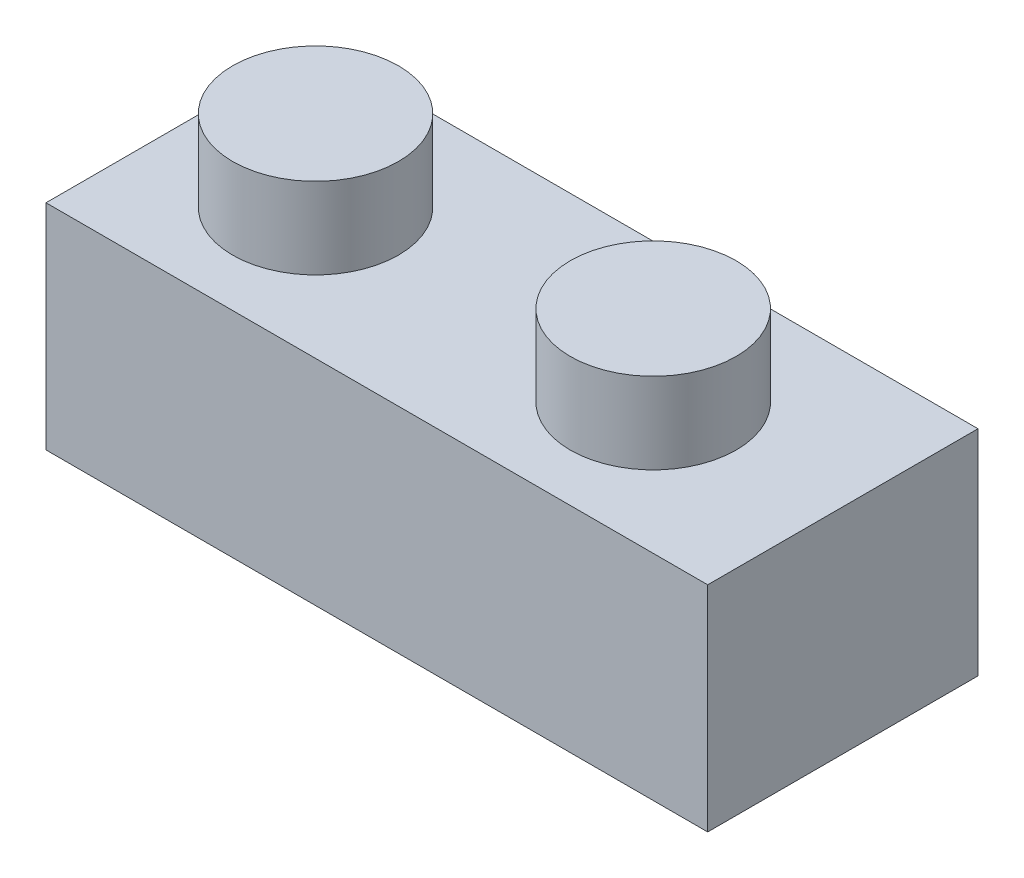
ISO-10303-21;
HEADER;
FILE_DESCRIPTION(('STEP AP214'),'2;1');
FILE_NAME('part.step','',(''),(''),'','','');
FILE_SCHEMA(('AUTOMOTIVE_DESIGN { 1 0 10303 214 1 1 1 1 }'));
ENDSEC;
DATA;
#1=APPLICATION_CONTEXT('core data for automotive mechanical design processes');
#2=APPLICATION_PROTOCOL_DEFINITION('international standard','automotive_design',2000,#1);
#3=PRODUCT_CONTEXT('',#1,'mechanical');
#4=PRODUCT('Part','Part','',(#3));
#5=PRODUCT_RELATED_PRODUCT_CATEGORY('part','',(#4));
#6=PRODUCT_DEFINITION_FORMATION('','',#4);
#7=PRODUCT_DEFINITION_CONTEXT('part definition',#1,'design');
#8=PRODUCT_DEFINITION('design','',#6,#7);
#9=PRODUCT_DEFINITION_SHAPE('','',#8);
#10=(LENGTH_UNIT() NAMED_UNIT(*) SI_UNIT(.MILLI.,.METRE.));
#11=(NAMED_UNIT(*) PLANE_ANGLE_UNIT() SI_UNIT($,.RADIAN.));
#12=(NAMED_UNIT(*) SI_UNIT($,.STERADIAN.) SOLID_ANGLE_UNIT());
#13=UNCERTAINTY_MEASURE_WITH_UNIT(LENGTH_MEASURE(1.E-05),#10,'distance_accuracy_value','');
#14=(GEOMETRIC_REPRESENTATION_CONTEXT(3) GLOBAL_UNCERTAINTY_ASSIGNED_CONTEXT((#13)) GLOBAL_UNIT_ASSIGNED_CONTEXT((#10,
#11,#12)) REPRESENTATION_CONTEXT('',''));
#15=CARTESIAN_POINT('',(0.,0.,0.));
#16=DIRECTION('',(0.,0.,1.));
#17=DIRECTION('',(1.,0.,0.));
#18=AXIS2_PLACEMENT_3D('',#15,#16,#17);
#19=CARTESIAN_POINT('',(0.,0.,0.01));
#20=DIRECTION('',(0.,1.,0.));
#21=DIRECTION('',(0.,0.,1.));
#22=AXIS2_PLACEMENT_3D('',#19,#20,#21);
#23=PLANE('',#22);
#24=DIRECTION('',(0.999961140271313,0.,0.00881577831473453));
#25=VECTOR('',#24,1.);
#26=CARTESIAN_POINT('',(0.000862531394720368,0.,0.000407757460154891));
#27=LINE('',#26,#25);
#28=CARTESIAN_POINT('',(0.000862531394720368,0.,0.000407757460154891));
#29=VERTEX_POINT('',#28);
#30=CARTESIAN_POINT('',(0.0237163099431462,0.,0.000609239135015069));
#31=VERTEX_POINT('',#30);
#32=EDGE_CURVE('E143',#29,#31,#27,.T.);
#33=ORIENTED_EDGE('',*,*,#32,.F.);
#34=DIRECTION('',(0.00881577831473453,0.,-0.999961140271313));
#35=VECTOR('',#34,1.);
#36=CARTESIAN_POINT('',(0.000784109218183198,0.,0.00930307291308525));
#37=LINE('',#36,#35);
#38=CARTESIAN_POINT('',(0.000784109218183198,0.,0.00930307291308525));
#39=VERTEX_POINT('',#38);
#40=EDGE_CURVE('E51',#39,#29,#37,.T.);
#41=ORIENTED_EDGE('',*,*,#40,.F.);
#42=DIRECTION('',(-0.999961140271313,0.,-0.00881577831473453));
#43=VECTOR('',#42,1.);
#44=CARTESIAN_POINT('',(0.000784109218183198,0.,0.00930307291308525));
#45=LINE('',#44,#43);
#46=CARTESIAN_POINT('',(0.023637887766609,0.,0.00950455458794542));
#47=VERTEX_POINT('',#46);
#48=EDGE_CURVE('E131',#47,#39,#45,.T.);
#49=ORIENTED_EDGE('',*,*,#48,.F.);
#50=DIRECTION('',(-0.00881577831473453,0.,0.999961140271313));
#51=VECTOR('',#50,1.);
#52=CARTESIAN_POINT('',(0.023637887766609,0.,0.00950455458794542));
#53=LINE('',#52,#51);
#54=EDGE_CURVE('E134',#31,#47,#53,.T.);
#55=ORIENTED_EDGE('',*,*,#54,.F.);
#56=EDGE_LOOP('',(#33,#41,#49,#55));
#57=FACE_BOUND('',#56,.T.);
#58=DIRECTION('',(1.,0.,0.));
#59=VECTOR('',#58,1.);
#60=CARTESIAN_POINT('',(0.,0.,0.));
#61=LINE('',#60,#59);
#62=CARTESIAN_POINT('',(0.,0.,0.));
#63=VERTEX_POINT('',#62);
#64=CARTESIAN_POINT('',(0.0244795631776094,0.,0.));
#65=VERTEX_POINT('',#64);
#66=EDGE_CURVE('E149',#63,#65,#61,.T.);
#67=ORIENTED_EDGE('',*,*,#66,.T.);
#68=DIRECTION('',(0.,0.,-1.));
#69=VECTOR('',#68,1.);
#70=CARTESIAN_POINT('',(0.0244795631776094,0.,0.01));
#71=LINE('',#70,#69);
#72=CARTESIAN_POINT('',(0.0244795631776094,0.,0.01));
#73=VERTEX_POINT('',#72);
#74=EDGE_CURVE('E173',#73,#65,#71,.T.);
#75=ORIENTED_EDGE('',*,*,#74,.F.);
#76=DIRECTION('',(1.,0.,0.));
#77=VECTOR('',#76,1.);
#78=CARTESIAN_POINT('',(0.,0.,0.01));
#79=LINE('',#78,#77);
#80=CARTESIAN_POINT('',(0.,0.,0.01));
#81=VERTEX_POINT('',#80);
#82=EDGE_CURVE('E153',#81,#73,#79,.T.);
#83=ORIENTED_EDGE('',*,*,#82,.F.);
#84=DIRECTION('',(0.,0.,-1.));
#85=VECTOR('',#84,1.);
#86=CARTESIAN_POINT('',(0.,0.,0.01));
#87=LINE('',#86,#85);
#88=EDGE_CURVE('E159',#81,#63,#87,.T.);
#89=ORIENTED_EDGE('',*,*,#88,.T.);
#90=EDGE_LOOP('',(#67,#75,#83,#89));
#91=FACE_BOUND('',#90,.T.);
#92=ADVANCED_FACE('F37',(#57,#91),#23,.F.);
#93=CARTESIAN_POINT('',(0.0244795631776094,0.,0.01));
#94=DIRECTION('',(-1.,0.,0.));
#95=DIRECTION('',(0.,0.,1.));
#96=AXIS2_PLACEMENT_3D('',#93,#94,#95);
#97=PLANE('',#96);
#98=DIRECTION('',(0.,1.,0.));
#99=VECTOR('',#98,1.);
#100=CARTESIAN_POINT('',(0.0244795631776094,0.,0.));
#101=LINE('',#100,#99);
#102=CARTESIAN_POINT('',(0.0244795631776094,0.00791951760061873,0.));
#103=VERTEX_POINT('',#102);
#104=EDGE_CURVE('E162',#65,#103,#101,.T.);
#105=ORIENTED_EDGE('',*,*,#104,.T.);
#106=DIRECTION('',(0.,0.,-1.));
#107=VECTOR('',#106,1.);
#108=CARTESIAN_POINT('',(0.0244795631776094,0.00791951760061873,0.01));
#109=LINE('',#108,#107);
#110=CARTESIAN_POINT('',(0.0244795631776094,0.00791951760061873,0.01));
#111=VERTEX_POINT('',#110);
#112=EDGE_CURVE('E170',#111,#103,#109,.T.);
#113=ORIENTED_EDGE('',*,*,#112,.F.);
#114=DIRECTION('',(0.,1.,0.));
#115=VECTOR('',#114,1.);
#116=CARTESIAN_POINT('',(0.0244795631776094,0.,0.01));
#117=LINE('',#116,#115);
#118=EDGE_CURVE('E89',#73,#111,#117,.T.);
#119=ORIENTED_EDGE('',*,*,#118,.F.);
#120=ORIENTED_EDGE('',*,*,#74,.T.);
#121=EDGE_LOOP('',(#105,#113,#119,#120));
#122=FACE_BOUND('',#121,.T.);
#123=ADVANCED_FACE('F183',(#122),#97,.F.);
#124=CARTESIAN_POINT('',(0.,0.00791951760061873,0.01));
#125=DIRECTION('',(0.,-1.,0.));
#126=DIRECTION('',(0.,0.,-1.));
#127=AXIS2_PLACEMENT_3D('',#124,#125,#126);
#128=PLANE('',#127);
#129=CARTESIAN_POINT('',(0.0176222206172123,0.00791951760061873,0.00515830703024725));
#130=DIRECTION('',(0.,-1.,0.));
#131=DIRECTION('',(0.,0.,-1.));
#132=AXIS2_PLACEMENT_3D('',#129,#130,#131);
#133=CIRCLE('',#132,0.003068475);
#134=CARTESIAN_POINT('',(0.0176222206172123,0.00791951760061873,0.00208983203024725));
#135=VERTEX_POINT('',#134);
#136=EDGE_CURVE('E11',#135,#135,#133,.F.);
#137=ORIENTED_EDGE('',*,*,#136,.F.);
#138=EDGE_LOOP('',(#137));
#139=FACE_BOUND('',#138,.T.);
#140=CARTESIAN_POINT('',(0.00513035677588131,0.00791951760061873,0.00515830703024725));
#141=DIRECTION('',(0.,-1.,0.));
#142=DIRECTION('',(0.,0.,-1.));
#143=AXIS2_PLACEMENT_3D('',#140,#141,#142);
#144=CIRCLE('',#143,0.00306847247840332);
#145=CARTESIAN_POINT('',(0.00513035677588131,0.00791951760061873,0.00208983455184393));
#146=VERTEX_POINT('',#145);
#147=EDGE_CURVE('E44',#146,#146,#144,.F.);
#148=ORIENTED_EDGE('',*,*,#147,.F.);
#149=EDGE_LOOP('',(#148));
#150=FACE_BOUND('',#149,.T.);
#151=DIRECTION('',(-1.,0.,0.));
#152=VECTOR('',#151,1.);
#153=CARTESIAN_POINT('',(0.,0.00791951760061873,0.));
#154=LINE('',#153,#152);
#155=CARTESIAN_POINT('',(0.,0.00791951760061873,0.));
#156=VERTEX_POINT('',#155);
#157=EDGE_CURVE('E164',#103,#156,#154,.T.);
#158=ORIENTED_EDGE('',*,*,#157,.T.);
#159=DIRECTION('',(0.,0.,-1.));
#160=VECTOR('',#159,1.);
#161=CARTESIAN_POINT('',(0.,0.00791951760061873,0.01));
#162=LINE('',#161,#160);
#163=CARTESIAN_POINT('',(0.,0.00791951760061873,0.01));
#164=VERTEX_POINT('',#163);
#165=EDGE_CURVE('E168',#164,#156,#162,.T.);
#166=ORIENTED_EDGE('',*,*,#165,.F.);
#167=DIRECTION('',(-1.,0.,0.));
#168=VECTOR('',#167,1.);
#169=CARTESIAN_POINT('',(0.,0.00791951760061873,0.01));
#170=LINE('',#169,#168);
#171=EDGE_CURVE('E156',#111,#164,#170,.T.);
#172=ORIENTED_EDGE('',*,*,#171,.F.);
#173=ORIENTED_EDGE('',*,*,#112,.T.);
#174=EDGE_LOOP('',(#158,#166,#172,#173));
#175=FACE_BOUND('',#174,.T.);
#176=ADVANCED_FACE('F179',(#139,#150,#175),#128,.F.);
#177=CARTESIAN_POINT('',(0.,0.,0.01));
#178=DIRECTION('',(1.,0.,0.));
#179=DIRECTION('',(0.,0.,-1.));
#180=AXIS2_PLACEMENT_3D('',#177,#178,#179);
#181=PLANE('',#180);
#182=DIRECTION('',(0.,-1.,0.));
#183=VECTOR('',#182,1.);
#184=CARTESIAN_POINT('',(0.,0.,0.));
#185=LINE('',#184,#183);
#186=EDGE_CURVE('E81',#156,#63,#185,.T.);
#187=ORIENTED_EDGE('',*,*,#186,.T.);
#188=ORIENTED_EDGE('',*,*,#88,.F.);
#189=DIRECTION('',(0.,-1.,0.));
#190=VECTOR('',#189,1.);
#191=CARTESIAN_POINT('',(0.,0.,0.01));
#192=LINE('',#191,#190);
#193=EDGE_CURVE('E60',#164,#81,#192,.T.);
#194=ORIENTED_EDGE('',*,*,#193,.F.);
#195=ORIENTED_EDGE('',*,*,#165,.T.);
#196=EDGE_LOOP('',(#187,#188,#194,#195));
#197=FACE_BOUND('',#196,.T.);
#198=ADVANCED_FACE('F182',(#197),#181,.F.);
#199=CARTESIAN_POINT('',(0.,0.,0.01));
#200=DIRECTION('',(0.,0.,1.));
#201=DIRECTION('',(1.,0.,0.));
#202=AXIS2_PLACEMENT_3D('',#199,#200,#201);
#203=PLANE('',#202);
#204=ORIENTED_EDGE('',*,*,#82,.T.);
#205=ORIENTED_EDGE('',*,*,#118,.T.);
#206=ORIENTED_EDGE('',*,*,#171,.T.);
#207=ORIENTED_EDGE('',*,*,#193,.T.);
#208=EDGE_LOOP('',(#204,#205,#206,#207));
#209=FACE_BOUND('',#208,.T.);
#210=ADVANCED_FACE('F195',(#209),#203,.T.);
#211=CARTESIAN_POINT('',(0.,0.,0.));
#212=DIRECTION('',(0.,0.,1.));
#213=DIRECTION('',(1.,0.,0.));
#214=AXIS2_PLACEMENT_3D('',#211,#212,#213);
#215=PLANE('',#214);
#216=ORIENTED_EDGE('',*,*,#66,.F.);
#217=ORIENTED_EDGE('',*,*,#186,.F.);
#218=ORIENTED_EDGE('',*,*,#157,.F.);
#219=ORIENTED_EDGE('',*,*,#104,.F.);
#220=EDGE_LOOP('',(#216,#217,#218,#219));
#221=FACE_BOUND('',#220,.T.);
#222=ADVANCED_FACE('F191',(#221),#215,.F.);
#223=CARTESIAN_POINT('',(0.000784109218183198,0.007,0.00930307291308525));
#224=DIRECTION('',(-0.999961140271313,0.,-0.00881577831473453));
#225=DIRECTION('',(-0.00881577831473453,0.,0.999961140271314));
#226=AXIS2_PLACEMENT_3D('',#223,#224,#225);
#227=PLANE('',#226);
#228=ORIENTED_EDGE('',*,*,#40,.T.);
#229=DIRECTION('',(0.,-1.,0.));
#230=VECTOR('',#229,1.);
#231=CARTESIAN_POINT('',(0.000862531394720368,0.007,0.000407757460154891));
#232=LINE('',#231,#230);
#233=CARTESIAN_POINT('',(0.000862531394720368,0.007,0.000407757460154891));
#234=VERTEX_POINT('',#233);
#235=EDGE_CURVE('E109',#234,#29,#232,.T.);
#236=ORIENTED_EDGE('',*,*,#235,.F.);
#237=DIRECTION('',(0.00881577831473453,0.,-0.999961140271313));
#238=VECTOR('',#237,1.);
#239=CARTESIAN_POINT('',(0.000784109218183198,0.007,0.00930307291308525));
#240=LINE('',#239,#238);
#241=CARTESIAN_POINT('',(0.000784109218183198,0.007,0.00930307291308525));
#242=VERTEX_POINT('',#241);
#243=EDGE_CURVE('E113',#242,#234,#240,.T.);
#244=ORIENTED_EDGE('',*,*,#243,.F.);
#245=DIRECTION('',(0.,-1.,0.));
#246=VECTOR('',#245,1.);
#247=CARTESIAN_POINT('',(0.000784109218183198,0.007,0.00930307291308525));
#248=LINE('',#247,#246);
#249=EDGE_CURVE('E147',#242,#39,#248,.T.);
#250=ORIENTED_EDGE('',*,*,#249,.T.);
#251=EDGE_LOOP('',(#228,#236,#244,#250));
#252=FACE_BOUND('',#251,.T.);
#253=ADVANCED_FACE('F111',(#252),#227,.F.);
#254=CARTESIAN_POINT('',(0.000784109218183198,0.007,0.00930307291308525));
#255=DIRECTION('',(-0.00881577831473453,0.,0.999961140271313));
#256=DIRECTION('',(0.999961140271314,0.,0.00881577831473454));
#257=AXIS2_PLACEMENT_3D('',#254,#255,#256);
#258=PLANE('',#257);
#259=ORIENTED_EDGE('',*,*,#48,.T.);
#260=ORIENTED_EDGE('',*,*,#249,.F.);
#261=DIRECTION('',(-0.999961140271313,0.,-0.00881577831473453));
#262=VECTOR('',#261,1.);
#263=CARTESIAN_POINT('',(0.000784109218183198,0.007,0.00930307291308525));
#264=LINE('',#263,#262);
#265=CARTESIAN_POINT('',(0.023637887766609,0.007,0.00950455458794542));
#266=VERTEX_POINT('',#265);
#267=EDGE_CURVE('E119',#266,#242,#264,.T.);
#268=ORIENTED_EDGE('',*,*,#267,.F.);
#269=DIRECTION('',(0.,-1.,0.));
#270=VECTOR('',#269,1.);
#271=CARTESIAN_POINT('',(0.023637887766609,0.007,0.00950455458794542));
#272=LINE('',#271,#270);
#273=EDGE_CURVE('E150',#266,#47,#272,.T.);
#274=ORIENTED_EDGE('',*,*,#273,.T.);
#275=EDGE_LOOP('',(#259,#260,#268,#274));
#276=FACE_BOUND('',#275,.T.);
#277=ADVANCED_FACE('F210',(#276),#258,.F.);
#278=CARTESIAN_POINT('',(0.023637887766609,0.007,0.00950455458794542));
#279=DIRECTION('',(0.999961140271313,0.,0.00881577831473453));
#280=DIRECTION('',(0.00881577831473453,0.,-0.999961140271314));
#281=AXIS2_PLACEMENT_3D('',#278,#279,#280);
#282=PLANE('',#281);
#283=ORIENTED_EDGE('',*,*,#54,.T.);
#284=ORIENTED_EDGE('',*,*,#273,.F.);
#285=DIRECTION('',(-0.00881577831473453,0.,0.999961140271313));
#286=VECTOR('',#285,1.);
#287=CARTESIAN_POINT('',(0.023637887766609,0.007,0.00950455458794542));
#288=LINE('',#287,#286);
#289=CARTESIAN_POINT('',(0.0237163099431462,0.007,0.000609239135015069));
#290=VERTEX_POINT('',#289);
#291=EDGE_CURVE('E127',#290,#266,#288,.T.);
#292=ORIENTED_EDGE('',*,*,#291,.F.);
#293=DIRECTION('',(0.,-1.,0.));
#294=VECTOR('',#293,1.);
#295=CARTESIAN_POINT('',(0.0237163099431462,0.007,0.000609239135015069));
#296=LINE('',#295,#294);
#297=EDGE_CURVE('E118',#290,#31,#296,.T.);
#298=ORIENTED_EDGE('',*,*,#297,.T.);
#299=EDGE_LOOP('',(#283,#284,#292,#298));
#300=FACE_BOUND('',#299,.T.);
#301=ADVANCED_FACE('F213',(#300),#282,.F.);
#302=CARTESIAN_POINT('',(0.000862531394720368,0.007,0.000407757460154891));
#303=DIRECTION('',(0.00881577831473453,0.,-0.999961140271313));
#304=DIRECTION('',(-0.999961140271314,0.,-0.00881577831473454));
#305=AXIS2_PLACEMENT_3D('',#302,#303,#304);
#306=PLANE('',#305);
#307=ORIENTED_EDGE('',*,*,#32,.T.);
#308=ORIENTED_EDGE('',*,*,#297,.F.);
#309=DIRECTION('',(0.999961140271313,0.,0.00881577831473453));
#310=VECTOR('',#309,1.);
#311=CARTESIAN_POINT('',(0.000862531394720368,0.007,0.000407757460154891));
#312=LINE('',#311,#310);
#313=EDGE_CURVE('E122',#234,#290,#312,.T.);
#314=ORIENTED_EDGE('',*,*,#313,.F.);
#315=ORIENTED_EDGE('',*,*,#235,.T.);
#316=EDGE_LOOP('',(#307,#308,#314,#315));
#317=FACE_BOUND('',#316,.T.);
#318=ADVANCED_FACE('F123',(#317),#306,.F.);
#319=CARTESIAN_POINT('',(0.,0.007,0.));
#320=DIRECTION('',(0.,-1.,0.));
#321=DIRECTION('',(0.,0.,-1.));
#322=AXIS2_PLACEMENT_3D('',#319,#320,#321);
#323=PLANE('',#322);
#324=CARTESIAN_POINT('',(0.0116670144620912,0.007,0.00496067358768393));
#325=DIRECTION('',(0.,-1.,0.));
#326=DIRECTION('',(0.,0.,-1.));
#327=AXIS2_PLACEMENT_3D('',#324,#325,#326);
#328=CIRCLE('',#327,0.00121060211636812);
#329=CARTESIAN_POINT('',(0.0116670144620912,0.007,0.0037500714713158));
#330=VERTEX_POINT('',#329);
#331=EDGE_CURVE('E251',#330,#330,#328,.T.);
#332=ORIENTED_EDGE('',*,*,#331,.F.);
#333=EDGE_LOOP('',(#332));
#334=FACE_BOUND('',#333,.T.);
#335=ORIENTED_EDGE('',*,*,#243,.T.);
#336=ORIENTED_EDGE('',*,*,#313,.T.);
#337=ORIENTED_EDGE('',*,*,#291,.T.);
#338=ORIENTED_EDGE('',*,*,#267,.T.);
#339=EDGE_LOOP('',(#335,#336,#337,#338));
#340=FACE_BOUND('',#339,.T.);
#341=ADVANCED_FACE('F129',(#334,#340),#323,.T.);
#342=CARTESIAN_POINT('',(0.00513035677588131,0.0109195176006187,0.00515830703024725));
#343=DIRECTION('',(0.,-1.,0.));
#344=DIRECTION('',(0.,0.,-1.));
#345=AXIS2_PLACEMENT_3D('',#342,#343,#344);
#346=CYLINDRICAL_SURFACE('',#345,0.00306847247840332);
#347=CARTESIAN_POINT('',(0.00513035677588131,0.0109195176006187,0.00515830703024725));
#348=DIRECTION('',(0.,1.,0.));
#349=DIRECTION('',(0.,0.,1.));
#350=AXIS2_PLACEMENT_3D('',#347,#348,#349);
#351=CIRCLE('',#350,0.00306847247840332);
#352=CARTESIAN_POINT('',(0.00513035677588131,0.0109195176006187,0.00822677950865058));
#353=VERTEX_POINT('',#352);
#354=EDGE_CURVE('E137',#353,#353,#351,.T.);
#355=ORIENTED_EDGE('',*,*,#354,.F.);
#356=EDGE_LOOP('',(#355));
#357=FACE_BOUND('',#356,.T.);
#358=ORIENTED_EDGE('',*,*,#147,.T.);
#359=EDGE_LOOP('',(#358));
#360=FACE_BOUND('',#359,.T.);
#361=ADVANCED_FACE('F177',(#357,#360),#346,.T.);
#362=CARTESIAN_POINT('',(0.00513035677588131,0.0109195176006187,0.00515830703024725));
#363=DIRECTION('',(0.,1.,0.));
#364=DIRECTION('',(0.,0.,1.));
#365=AXIS2_PLACEMENT_3D('',#362,#363,#364);
#366=PLANE('',#365);
#367=ORIENTED_EDGE('',*,*,#354,.T.);
#368=EDGE_LOOP('',(#367));
#369=FACE_BOUND('',#368,.T.);
#370=ADVANCED_FACE('F225',(#369),#366,.T.);
#371=CARTESIAN_POINT('',(0.0176222206172123,0.0109195176006187,0.00515830703024725));
#372=DIRECTION('',(0.,-1.,0.));
#373=DIRECTION('',(0.,0.,-1.));
#374=AXIS2_PLACEMENT_3D('',#371,#372,#373);
#375=CYLINDRICAL_SURFACE('',#374,0.003068475);
#376=CARTESIAN_POINT('',(0.0176222206172123,0.0109195176006187,0.00515830703024725));
#377=DIRECTION('',(0.,1.,0.));
#378=DIRECTION('',(0.,0.,1.));
#379=AXIS2_PLACEMENT_3D('',#376,#377,#378);
#380=CIRCLE('',#379,0.003068475);
#381=CARTESIAN_POINT('',(0.0176222206172123,0.0109195176006187,0.00822678203024725));
#382=VERTEX_POINT('',#381);
#383=EDGE_CURVE('E250',#382,#382,#380,.T.);
#384=ORIENTED_EDGE('',*,*,#383,.F.);
#385=EDGE_LOOP('',(#384));
#386=FACE_BOUND('',#385,.T.);
#387=ORIENTED_EDGE('',*,*,#136,.T.);
#388=EDGE_LOOP('',(#387));
#389=FACE_BOUND('',#388,.T.);
#390=ADVANCED_FACE('F229',(#386,#389),#375,.T.);
#391=CARTESIAN_POINT('',(0.0176222206172123,0.0109195176006187,0.00515830703024725));
#392=DIRECTION('',(0.,1.,0.));
#393=DIRECTION('',(0.,0.,1.));
#394=AXIS2_PLACEMENT_3D('',#391,#392,#393);
#395=PLANE('',#394);
#396=ORIENTED_EDGE('',*,*,#383,.T.);
#397=EDGE_LOOP('',(#396));
#398=FACE_BOUND('',#397,.T.);
#399=ADVANCED_FACE('F231',(#398),#395,.T.);
#400=CARTESIAN_POINT('',(0.0116670144620912,0.0005,0.00496067358768393));
#401=DIRECTION('',(0.,1.,0.));
#402=DIRECTION('',(0.,0.,1.));
#403=AXIS2_PLACEMENT_3D('',#400,#401,#402);
#404=CYLINDRICAL_SURFACE('',#403,0.00121060211636812);
#405=CARTESIAN_POINT('',(0.0116670144620912,0.0005,0.00496067358768393));
#406=DIRECTION('',(0.,-1.,0.));
#407=DIRECTION('',(0.,0.,-1.));
#408=AXIS2_PLACEMENT_3D('',#405,#406,#407);
#409=CIRCLE('',#408,0.00121060211636812);
#410=CARTESIAN_POINT('',(0.0116670144620912,0.0005,0.0037500714713158));
#411=VERTEX_POINT('',#410);
#412=EDGE_CURVE('E249',#411,#411,#409,.T.);
#413=ORIENTED_EDGE('',*,*,#412,.F.);
#414=EDGE_LOOP('',(#413));
#415=FACE_BOUND('',#414,.T.);
#416=ORIENTED_EDGE('',*,*,#331,.T.);
#417=EDGE_LOOP('',(#416));
#418=FACE_BOUND('',#417,.T.);
#419=ADVANCED_FACE('F234',(#415,#418),#404,.T.);
#420=CARTESIAN_POINT('',(0.0116670144620912,0.0005,0.00496067358768393));
#421=DIRECTION('',(0.,-1.,0.));
#422=DIRECTION('',(0.,0.,-1.));
#423=AXIS2_PLACEMENT_3D('',#420,#421,#422);
#424=PLANE('',#423);
#425=ORIENTED_EDGE('',*,*,#412,.T.);
#426=EDGE_LOOP('',(#425));
#427=FACE_BOUND('',#426,.T.);
#428=ADVANCED_FACE('F241',(#427),#424,.T.);
#429=CLOSED_SHELL('',(#92,#123,#176,#198,#210,#222,#253,#277,#301,#318,#341,#361,#370,#390,#399,
#419,#428));
#430=MANIFOLD_SOLID_BREP('B2',#429);
#431=ADVANCED_BREP_SHAPE_REPRESENTATION('',(#18,#430),#14);
#432=SHAPE_DEFINITION_REPRESENTATION(#9,#431);
ENDSEC;
END-ISO-10303-21;
